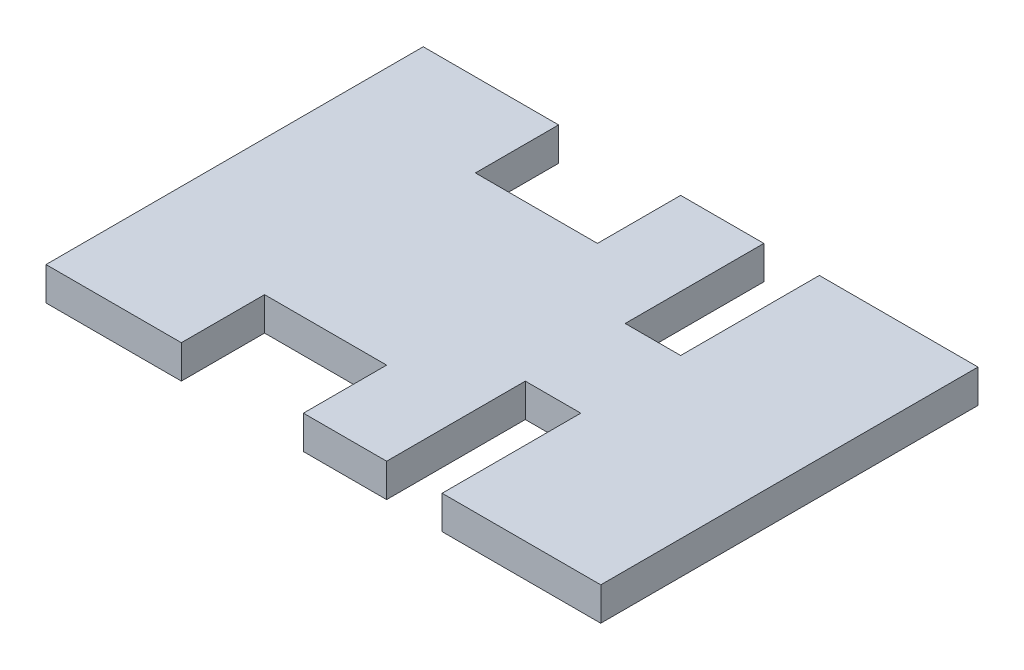
ISO-10303-21;
HEADER;
FILE_DESCRIPTION(('STEP AP214'),'2;1');
FILE_NAME('part.step','',(''),(''),'','','');
FILE_SCHEMA(('AUTOMOTIVE_DESIGN { 1 0 10303 214 1 1 1 1 }'));
ENDSEC;
DATA;
#1=APPLICATION_CONTEXT('core data for automotive mechanical design processes');
#2=APPLICATION_PROTOCOL_DEFINITION('international standard','automotive_design',2000,#1);
#3=PRODUCT_CONTEXT('',#1,'mechanical');
#4=PRODUCT('Part','Part','',(#3));
#5=PRODUCT_RELATED_PRODUCT_CATEGORY('part','',(#4));
#6=PRODUCT_DEFINITION_FORMATION('','',#4);
#7=PRODUCT_DEFINITION_CONTEXT('part definition',#1,'design');
#8=PRODUCT_DEFINITION('design','',#6,#7);
#9=PRODUCT_DEFINITION_SHAPE('','',#8);
#10=(LENGTH_UNIT() NAMED_UNIT(*) SI_UNIT(.MILLI.,.METRE.));
#11=(NAMED_UNIT(*) PLANE_ANGLE_UNIT() SI_UNIT($,.RADIAN.));
#12=(NAMED_UNIT(*) SI_UNIT($,.STERADIAN.) SOLID_ANGLE_UNIT());
#13=UNCERTAINTY_MEASURE_WITH_UNIT(LENGTH_MEASURE(1.E-05),#10,'distance_accuracy_value','');
#14=(GEOMETRIC_REPRESENTATION_CONTEXT(3) GLOBAL_UNCERTAINTY_ASSIGNED_CONTEXT((#13)) GLOBAL_UNIT_ASSIGNED_CONTEXT((#10,
#11,#12)) REPRESENTATION_CONTEXT('',''));
#15=CARTESIAN_POINT('',(0.,0.,0.));
#16=DIRECTION('',(0.,0.,1.));
#17=DIRECTION('',(1.,0.,0.));
#18=AXIS2_PLACEMENT_3D('',#15,#16,#17);
#19=CARTESIAN_POINT('',(-50.,6.,-34.));
#20=DIRECTION('',(0.,0.,1.));
#21=DIRECTION('',(1.,0.,0.));
#22=AXIS2_PLACEMENT_3D('',#19,#20,#21);
#23=PLANE('',#22);
#24=DIRECTION('',(0.,1.,0.));
#25=VECTOR('',#24,1.);
#26=CARTESIAN_POINT('',(-3.59999999999995,0.,-34.));
#27=LINE('',#26,#25);
#28=CARTESIAN_POINT('',(-3.59999999999995,0.,-34.));
#29=VERTEX_POINT('',#28);
#30=CARTESIAN_POINT('',(-3.59999999999995,6.,-34.));
#31=VERTEX_POINT('',#30);
#32=EDGE_CURVE('E171',#29,#31,#27,.T.);
#33=ORIENTED_EDGE('',*,*,#32,.T.);
#34=DIRECTION('',(-1.,0.,0.));
#35=VECTOR('',#34,1.);
#36=CARTESIAN_POINT('',(-50.,6.,-34.));
#37=LINE('',#36,#35);
#38=CARTESIAN_POINT('',(11.4000000000001,6.,-34.));
#39=VERTEX_POINT('',#38);
#40=EDGE_CURVE('E252',#39,#31,#37,.T.);
#41=ORIENTED_EDGE('',*,*,#40,.F.);
#42=DIRECTION('',(0.,1.,0.));
#43=VECTOR('',#42,1.);
#44=CARTESIAN_POINT('',(11.4000000000001,0.,-34.));
#45=LINE('',#44,#43);
#46=CARTESIAN_POINT('',(11.4000000000001,0.,-34.));
#47=VERTEX_POINT('',#46);
#48=EDGE_CURVE('E197',#47,#39,#45,.T.);
#49=ORIENTED_EDGE('',*,*,#48,.F.);
#50=DIRECTION('',(-1.,0.,0.));
#51=VECTOR('',#50,1.);
#52=CARTESIAN_POINT('',(-50.,0.,-34.));
#53=LINE('',#52,#51);
#54=EDGE_CURVE('E191',#47,#29,#53,.T.);
#55=ORIENTED_EDGE('',*,*,#54,.T.);
#56=EDGE_LOOP('',(#33,#41,#49,#55));
#57=FACE_BOUND('',#56,.T.);
#58=ADVANCED_FACE('F35',(#57),#23,.F.);
#59=DIRECTION('',(0.,1.,0.));
#60=VECTOR('',#59,1.);
#61=CARTESIAN_POINT('',(-25.5999999999999,0.,-34.));
#62=LINE('',#61,#60);
#63=CARTESIAN_POINT('',(-25.5999999999999,0.,-34.));
#64=VERTEX_POINT('',#63);
#65=CARTESIAN_POINT('',(-25.5999999999999,6.,-34.));
#66=VERTEX_POINT('',#65);
#67=EDGE_CURVE('E183',#64,#66,#62,.T.);
#68=ORIENTED_EDGE('',*,*,#67,.F.);
#69=CARTESIAN_POINT('',(-50.,0.,-34.));
#70=VERTEX_POINT('',#69);
#71=EDGE_CURVE('E199',#64,#70,#53,.T.);
#72=ORIENTED_EDGE('',*,*,#71,.T.);
#73=DIRECTION('',(0.,-1.,0.));
#74=VECTOR('',#73,1.);
#75=CARTESIAN_POINT('',(-50.,6.,-34.));
#76=LINE('',#75,#74);
#77=CARTESIAN_POINT('',(-50.,6.,-34.));
#78=VERTEX_POINT('',#77);
#79=EDGE_CURVE('E43',#78,#70,#76,.T.);
#80=ORIENTED_EDGE('',*,*,#79,.F.);
#81=EDGE_CURVE('E254',#66,#78,#37,.T.);
#82=ORIENTED_EDGE('',*,*,#81,.F.);
#83=EDGE_LOOP('',(#68,#72,#80,#82));
#84=FACE_BOUND('',#83,.T.);
#85=ADVANCED_FACE('F341',(#84),#23,.F.);
#86=CARTESIAN_POINT('',(0.,6.,0.));
#87=DIRECTION('',(0.,1.,0.));
#88=DIRECTION('',(0.,0.,1.));
#89=AXIS2_PLACEMENT_3D('',#86,#87,#88);
#90=PLANE('',#89);
#91=ORIENTED_EDGE('',*,*,#40,.T.);
#92=DIRECTION('',(0.,0.,1.));
#93=VECTOR('',#92,1.);
#94=CARTESIAN_POINT('',(-3.59999999999995,6.,-34.));
#95=LINE('',#94,#93);
#96=CARTESIAN_POINT('',(-3.59999999999994,6.,-19.));
#97=VERTEX_POINT('',#96);
#98=EDGE_CURVE('E178',#31,#97,#95,.T.);
#99=ORIENTED_EDGE('',*,*,#98,.T.);
#100=DIRECTION('',(-1.,0.,0.));
#101=VECTOR('',#100,1.);
#102=CARTESIAN_POINT('',(-3.59999999999994,6.,-19.));
#103=LINE('',#102,#101);
#104=CARTESIAN_POINT('',(-25.5999999999999,6.,-19.));
#105=VERTEX_POINT('',#104);
#106=EDGE_CURVE('E194',#97,#105,#103,.T.);
#107=ORIENTED_EDGE('',*,*,#106,.T.);
#108=DIRECTION('',(0.,0.,-1.));
#109=VECTOR('',#108,1.);
#110=CARTESIAN_POINT('',(-25.5999999999999,6.,-34.));
#111=LINE('',#110,#109);
#112=EDGE_CURVE('E334',#105,#66,#111,.T.);
#113=ORIENTED_EDGE('',*,*,#112,.T.);
#114=ORIENTED_EDGE('',*,*,#81,.T.);
#115=DIRECTION('',(0.,0.,1.));
#116=VECTOR('',#115,1.);
#117=CARTESIAN_POINT('',(-50.,6.,-34.));
#118=LINE('',#117,#116);
#119=CARTESIAN_POINT('',(-50.,6.,34.));
#120=VERTEX_POINT('',#119);
#121=EDGE_CURVE('E227',#78,#120,#118,.T.);
#122=ORIENTED_EDGE('',*,*,#121,.T.);
#123=DIRECTION('',(1.,0.,0.));
#124=VECTOR('',#123,1.);
#125=CARTESIAN_POINT('',(-50.,6.,34.));
#126=LINE('',#125,#124);
#127=CARTESIAN_POINT('',(-25.5999999999999,6.,34.));
#128=VERTEX_POINT('',#127);
#129=EDGE_CURVE('E218',#120,#128,#126,.T.);
#130=ORIENTED_EDGE('',*,*,#129,.T.);
#131=DIRECTION('',(0.,0.,1.));
#132=VECTOR('',#131,1.);
#133=CARTESIAN_POINT('',(-25.5999999999999,6.,34.));
#134=LINE('',#133,#132);
#135=CARTESIAN_POINT('',(-25.5999999999999,6.,19.));
#136=VERTEX_POINT('',#135);
#137=EDGE_CURVE('E291',#136,#128,#134,.T.);
#138=ORIENTED_EDGE('',*,*,#137,.F.);
#139=DIRECTION('',(-1.,0.,0.));
#140=VECTOR('',#139,1.);
#141=CARTESIAN_POINT('',(-3.59999999999994,6.,19.));
#142=LINE('',#141,#140);
#143=CARTESIAN_POINT('',(-3.59999999999994,6.,19.));
#144=VERTEX_POINT('',#143);
#145=EDGE_CURVE('E294',#144,#136,#142,.T.);
#146=ORIENTED_EDGE('',*,*,#145,.F.);
#147=DIRECTION('',(0.,0.,-1.));
#148=VECTOR('',#147,1.);
#149=CARTESIAN_POINT('',(-3.59999999999995,6.,34.));
#150=LINE('',#149,#148);
#151=CARTESIAN_POINT('',(-3.59999999999995,6.,34.));
#152=VERTEX_POINT('',#151);
#153=EDGE_CURVE('E297',#152,#144,#150,.T.);
#154=ORIENTED_EDGE('',*,*,#153,.F.);
#155=CARTESIAN_POINT('',(11.4000000000001,6.,34.));
#156=VERTEX_POINT('',#155);
#157=EDGE_CURVE('E243',#152,#156,#126,.T.);
#158=ORIENTED_EDGE('',*,*,#157,.T.);
#159=DIRECTION('',(0.,0.,1.));
#160=VECTOR('',#159,1.);
#161=CARTESIAN_POINT('',(11.4000000000001,6.,34.));
#162=LINE('',#161,#160);
#163=CARTESIAN_POINT('',(11.4000000000001,6.,9.));
#164=VERTEX_POINT('',#163);
#165=EDGE_CURVE('E267',#164,#156,#162,.T.);
#166=ORIENTED_EDGE('',*,*,#165,.F.);
#167=DIRECTION('',(-1.,0.,0.));
#168=VECTOR('',#167,1.);
#169=CARTESIAN_POINT('',(21.4000000000001,6.,9.));
#170=LINE('',#169,#168);
#171=CARTESIAN_POINT('',(21.4000000000001,6.,9.));
#172=VERTEX_POINT('',#171);
#173=EDGE_CURVE('E271',#172,#164,#170,.T.);
#174=ORIENTED_EDGE('',*,*,#173,.F.);
#175=DIRECTION('',(0.,0.,-1.));
#176=VECTOR('',#175,1.);
#177=CARTESIAN_POINT('',(21.4000000000001,6.,34.));
#178=LINE('',#177,#176);
#179=CARTESIAN_POINT('',(21.4000000000001,6.,34.));
#180=VERTEX_POINT('',#179);
#181=EDGE_CURVE('E274',#180,#172,#178,.T.);
#182=ORIENTED_EDGE('',*,*,#181,.F.);
#183=CARTESIAN_POINT('',(50.,6.,34.));
#184=VERTEX_POINT('',#183);
#185=EDGE_CURVE('E244',#180,#184,#126,.T.);
#186=ORIENTED_EDGE('',*,*,#185,.T.);
#187=DIRECTION('',(0.,0.,-1.));
#188=VECTOR('',#187,1.);
#189=CARTESIAN_POINT('',(50.,6.,-34.));
#190=LINE('',#189,#188);
#191=CARTESIAN_POINT('',(50.,6.,-34.));
#192=VERTEX_POINT('',#191);
#193=EDGE_CURVE('E212',#184,#192,#190,.T.);
#194=ORIENTED_EDGE('',*,*,#193,.T.);
#195=CARTESIAN_POINT('',(21.4000000000001,6.,-34.));
#196=VERTEX_POINT('',#195);
#197=EDGE_CURVE('E250',#192,#196,#37,.T.);
#198=ORIENTED_EDGE('',*,*,#197,.T.);
#199=DIRECTION('',(0.,0.,1.));
#200=VECTOR('',#199,1.);
#201=CARTESIAN_POINT('',(21.4000000000001,6.,-34.));
#202=LINE('',#201,#200);
#203=CARTESIAN_POINT('',(21.4000000000001,6.,-9.));
#204=VERTEX_POINT('',#203);
#205=EDGE_CURVE('E321',#196,#204,#202,.T.);
#206=ORIENTED_EDGE('',*,*,#205,.T.);
#207=DIRECTION('',(-1.,0.,0.));
#208=VECTOR('',#207,1.);
#209=CARTESIAN_POINT('',(21.4000000000001,6.,-9.));
#210=LINE('',#209,#208);
#211=CARTESIAN_POINT('',(11.4000000000001,6.,-9.));
#212=VERTEX_POINT('',#211);
#213=EDGE_CURVE('E314',#204,#212,#210,.T.);
#214=ORIENTED_EDGE('',*,*,#213,.T.);
#215=DIRECTION('',(0.,0.,-1.));
#216=VECTOR('',#215,1.);
#217=CARTESIAN_POINT('',(11.4000000000001,6.,-34.));
#218=LINE('',#217,#216);
#219=EDGE_CURVE('E318',#212,#39,#218,.T.);
#220=ORIENTED_EDGE('',*,*,#219,.T.);
#221=EDGE_LOOP('',(#91,#99,#107,#113,#114,#122,#130,#138,#146,#154,#158,#166,#174,#182,#186,
#194,#198,#206,#214,#220));
#222=FACE_BOUND('',#221,.T.);
#223=ADVANCED_FACE('F342',(#222),#90,.T.);
#224=CARTESIAN_POINT('',(0.,0.,0.));
#225=DIRECTION('',(0.,1.,0.));
#226=DIRECTION('',(0.,0.,1.));
#227=AXIS2_PLACEMENT_3D('',#224,#225,#226);
#228=PLANE('',#227);
#229=DIRECTION('',(0.,0.,1.));
#230=VECTOR('',#229,1.);
#231=CARTESIAN_POINT('',(-3.59999999999995,0.,-34.));
#232=LINE('',#231,#230);
#233=CARTESIAN_POINT('',(-3.59999999999994,0.,-19.));
#234=VERTEX_POINT('',#233);
#235=EDGE_CURVE('E175',#29,#234,#232,.T.);
#236=ORIENTED_EDGE('',*,*,#235,.F.);
#237=ORIENTED_EDGE('',*,*,#54,.F.);
#238=DIRECTION('',(0.,0.,-1.));
#239=VECTOR('',#238,1.);
#240=CARTESIAN_POINT('',(11.4000000000001,0.,-34.));
#241=LINE('',#240,#239);
#242=CARTESIAN_POINT('',(11.4000000000001,0.,-9.));
#243=VERTEX_POINT('',#242);
#244=EDGE_CURVE('E326',#243,#47,#241,.T.);
#245=ORIENTED_EDGE('',*,*,#244,.F.);
#246=DIRECTION('',(-1.,0.,0.));
#247=VECTOR('',#246,1.);
#248=CARTESIAN_POINT('',(21.4000000000001,0.,-9.));
#249=LINE('',#248,#247);
#250=CARTESIAN_POINT('',(21.4000000000001,0.,-9.));
#251=VERTEX_POINT('',#250);
#252=EDGE_CURVE('E309',#251,#243,#249,.T.);
#253=ORIENTED_EDGE('',*,*,#252,.F.);
#254=DIRECTION('',(0.,0.,1.));
#255=VECTOR('',#254,1.);
#256=CARTESIAN_POINT('',(21.4000000000001,0.,-34.));
#257=LINE('',#256,#255);
#258=CARTESIAN_POINT('',(21.4000000000001,0.,-34.));
#259=VERTEX_POINT('',#258);
#260=EDGE_CURVE('E317',#259,#251,#257,.T.);
#261=ORIENTED_EDGE('',*,*,#260,.F.);
#262=CARTESIAN_POINT('',(50.,0.,-34.));
#263=VERTEX_POINT('',#262);
#264=EDGE_CURVE('E198',#263,#259,#53,.T.);
#265=ORIENTED_EDGE('',*,*,#264,.F.);
#266=DIRECTION('',(0.,0.,-1.));
#267=VECTOR('',#266,1.);
#268=CARTESIAN_POINT('',(50.,0.,-34.));
#269=LINE('',#268,#267);
#270=CARTESIAN_POINT('',(50.,0.,34.));
#271=VERTEX_POINT('',#270);
#272=EDGE_CURVE('E203',#271,#263,#269,.T.);
#273=ORIENTED_EDGE('',*,*,#272,.F.);
#274=DIRECTION('',(1.,0.,0.));
#275=VECTOR('',#274,1.);
#276=CARTESIAN_POINT('',(-50.,0.,34.));
#277=LINE('',#276,#275);
#278=CARTESIAN_POINT('',(21.4000000000001,0.,34.));
#279=VERTEX_POINT('',#278);
#280=EDGE_CURVE('E208',#279,#271,#277,.T.);
#281=ORIENTED_EDGE('',*,*,#280,.F.);
#282=DIRECTION('',(0.,0.,-1.));
#283=VECTOR('',#282,1.);
#284=CARTESIAN_POINT('',(21.4000000000001,0.,34.));
#285=LINE('',#284,#283);
#286=CARTESIAN_POINT('',(21.4000000000001,0.,9.));
#287=VERTEX_POINT('',#286);
#288=EDGE_CURVE('E270',#279,#287,#285,.T.);
#289=ORIENTED_EDGE('',*,*,#288,.T.);
#290=DIRECTION('',(-1.,0.,0.));
#291=VECTOR('',#290,1.);
#292=CARTESIAN_POINT('',(21.4000000000001,0.,9.));
#293=LINE('',#292,#291);
#294=CARTESIAN_POINT('',(11.4000000000001,0.,9.));
#295=VERTEX_POINT('',#294);
#296=EDGE_CURVE('E280',#287,#295,#293,.T.);
#297=ORIENTED_EDGE('',*,*,#296,.T.);
#298=DIRECTION('',(0.,0.,1.));
#299=VECTOR('',#298,1.);
#300=CARTESIAN_POINT('',(11.4000000000001,0.,34.));
#301=LINE('',#300,#299);
#302=CARTESIAN_POINT('',(11.4000000000001,0.,34.));
#303=VERTEX_POINT('',#302);
#304=EDGE_CURVE('E260',#295,#303,#301,.T.);
#305=ORIENTED_EDGE('',*,*,#304,.T.);
#306=CARTESIAN_POINT('',(-3.59999999999995,0.,34.));
#307=VERTEX_POINT('',#306);
#308=EDGE_CURVE('E213',#307,#303,#277,.T.);
#309=ORIENTED_EDGE('',*,*,#308,.F.);
#310=DIRECTION('',(0.,0.,-1.));
#311=VECTOR('',#310,1.);
#312=CARTESIAN_POINT('',(-3.59999999999995,0.,34.));
#313=LINE('',#312,#311);
#314=CARTESIAN_POINT('',(-3.59999999999994,0.,19.));
#315=VERTEX_POINT('',#314);
#316=EDGE_CURVE('E293',#307,#315,#313,.T.);
#317=ORIENTED_EDGE('',*,*,#316,.T.);
#318=DIRECTION('',(-1.,0.,0.));
#319=VECTOR('',#318,1.);
#320=CARTESIAN_POINT('',(-3.59999999999994,0.,19.));
#321=LINE('',#320,#319);
#322=CARTESIAN_POINT('',(-25.5999999999999,0.,19.));
#323=VERTEX_POINT('',#322);
#324=EDGE_CURVE('E302',#315,#323,#321,.T.);
#325=ORIENTED_EDGE('',*,*,#324,.T.);
#326=DIRECTION('',(0.,0.,1.));
#327=VECTOR('',#326,1.);
#328=CARTESIAN_POINT('',(-25.5999999999999,0.,34.));
#329=LINE('',#328,#327);
#330=CARTESIAN_POINT('',(-25.5999999999999,0.,34.));
#331=VERTEX_POINT('',#330);
#332=EDGE_CURVE('E234',#323,#331,#329,.T.);
#333=ORIENTED_EDGE('',*,*,#332,.T.);
#334=CARTESIAN_POINT('',(-50.,0.,34.));
#335=VERTEX_POINT('',#334);
#336=EDGE_CURVE('E209',#335,#331,#277,.T.);
#337=ORIENTED_EDGE('',*,*,#336,.F.);
#338=DIRECTION('',(0.,0.,1.));
#339=VECTOR('',#338,1.);
#340=CARTESIAN_POINT('',(-50.,0.,-34.));
#341=LINE('',#340,#339);
#342=EDGE_CURVE('E202',#70,#335,#341,.T.);
#343=ORIENTED_EDGE('',*,*,#342,.F.);
#344=ORIENTED_EDGE('',*,*,#71,.F.);
#345=DIRECTION('',(0.,0.,-1.));
#346=VECTOR('',#345,1.);
#347=CARTESIAN_POINT('',(-25.5999999999999,0.,-34.));
#348=LINE('',#347,#346);
#349=CARTESIAN_POINT('',(-25.5999999999999,0.,-19.));
#350=VERTEX_POINT('',#349);
#351=EDGE_CURVE('E193',#350,#64,#348,.T.);
#352=ORIENTED_EDGE('',*,*,#351,.F.);
#353=DIRECTION('',(-1.,0.,0.));
#354=VECTOR('',#353,1.);
#355=CARTESIAN_POINT('',(-3.59999999999994,0.,-19.));
#356=LINE('',#355,#354);
#357=EDGE_CURVE('E184',#234,#350,#356,.T.);
#358=ORIENTED_EDGE('',*,*,#357,.F.);
#359=EDGE_LOOP('',(#236,#237,#245,#253,#261,#265,#273,#281,#289,#297,#305,#309,#317,#325,#333,
#337,#343,#344,#352,#358));
#360=FACE_BOUND('',#359,.T.);
#361=ADVANCED_FACE('F189',(#360),#228,.F.);
#362=DIRECTION('',(0.,1.,0.));
#363=VECTOR('',#362,1.);
#364=CARTESIAN_POINT('',(21.4000000000001,0.,-34.));
#365=LINE('',#364,#363);
#366=EDGE_CURVE('E306',#259,#196,#365,.T.);
#367=ORIENTED_EDGE('',*,*,#366,.T.);
#368=ORIENTED_EDGE('',*,*,#197,.F.);
#369=DIRECTION('',(0.,-1.,0.));
#370=VECTOR('',#369,1.);
#371=CARTESIAN_POINT('',(50.,6.,-34.));
#372=LINE('',#371,#370);
#373=EDGE_CURVE('E11',#192,#263,#372,.T.);
#374=ORIENTED_EDGE('',*,*,#373,.T.);
#375=ORIENTED_EDGE('',*,*,#264,.T.);
#376=EDGE_LOOP('',(#367,#368,#374,#375));
#377=FACE_BOUND('',#376,.T.);
#378=ADVANCED_FACE('F354',(#377),#23,.F.);
#379=CARTESIAN_POINT('',(-50.,6.,34.));
#380=DIRECTION('',(0.,0.,-1.));
#381=DIRECTION('',(-1.,0.,0.));
#382=AXIS2_PLACEMENT_3D('',#379,#380,#381);
#383=PLANE('',#382);
#384=ORIENTED_EDGE('',*,*,#157,.F.);
#385=DIRECTION('',(0.,1.,0.));
#386=VECTOR('',#385,1.);
#387=CARTESIAN_POINT('',(-3.59999999999995,0.,34.));
#388=LINE('',#387,#386);
#389=EDGE_CURVE('E277',#307,#152,#388,.T.);
#390=ORIENTED_EDGE('',*,*,#389,.F.);
#391=ORIENTED_EDGE('',*,*,#308,.T.);
#392=DIRECTION('',(0.,1.,0.));
#393=VECTOR('',#392,1.);
#394=CARTESIAN_POINT('',(11.4000000000001,0.,34.));
#395=LINE('',#394,#393);
#396=EDGE_CURVE('E262',#303,#156,#395,.T.);
#397=ORIENTED_EDGE('',*,*,#396,.T.);
#398=EDGE_LOOP('',(#384,#390,#391,#397));
#399=FACE_BOUND('',#398,.T.);
#400=ADVANCED_FACE('F367',(#399),#383,.F.);
#401=ORIENTED_EDGE('',*,*,#185,.F.);
#402=DIRECTION('',(0.,1.,0.));
#403=VECTOR('',#402,1.);
#404=CARTESIAN_POINT('',(21.4000000000001,0.,34.));
#405=LINE('',#404,#403);
#406=EDGE_CURVE('E265',#279,#180,#405,.T.);
#407=ORIENTED_EDGE('',*,*,#406,.F.);
#408=ORIENTED_EDGE('',*,*,#280,.T.);
#409=DIRECTION('',(0.,-1.,0.));
#410=VECTOR('',#409,1.);
#411=CARTESIAN_POINT('',(50.,6.,34.));
#412=LINE('',#411,#410);
#413=EDGE_CURVE('E214',#184,#271,#412,.T.);
#414=ORIENTED_EDGE('',*,*,#413,.F.);
#415=EDGE_LOOP('',(#401,#407,#408,#414));
#416=FACE_BOUND('',#415,.T.);
#417=ADVANCED_FACE('F360',(#416),#383,.F.);
#418=CARTESIAN_POINT('',(50.,6.,-34.));
#419=DIRECTION('',(-1.,0.,0.));
#420=DIRECTION('',(0.,0.,1.));
#421=AXIS2_PLACEMENT_3D('',#418,#419,#420);
#422=PLANE('',#421);
#423=ORIENTED_EDGE('',*,*,#272,.T.);
#424=ORIENTED_EDGE('',*,*,#373,.F.);
#425=ORIENTED_EDGE('',*,*,#193,.F.);
#426=ORIENTED_EDGE('',*,*,#413,.T.);
#427=EDGE_LOOP('',(#423,#424,#425,#426));
#428=FACE_BOUND('',#427,.T.);
#429=ADVANCED_FACE('F37',(#428),#422,.F.);
#430=CARTESIAN_POINT('',(-50.,6.,-34.));
#431=DIRECTION('',(1.,0.,0.));
#432=DIRECTION('',(0.,0.,-1.));
#433=AXIS2_PLACEMENT_3D('',#430,#431,#432);
#434=PLANE('',#433);
#435=ORIENTED_EDGE('',*,*,#342,.T.);
#436=DIRECTION('',(0.,-1.,0.));
#437=VECTOR('',#436,1.);
#438=CARTESIAN_POINT('',(-50.,6.,34.));
#439=LINE('',#438,#437);
#440=EDGE_CURVE('E217',#120,#335,#439,.T.);
#441=ORIENTED_EDGE('',*,*,#440,.F.);
#442=ORIENTED_EDGE('',*,*,#121,.F.);
#443=ORIENTED_EDGE('',*,*,#79,.T.);
#444=EDGE_LOOP('',(#435,#441,#442,#443));
#445=FACE_BOUND('',#444,.T.);
#446=ADVANCED_FACE('F225',(#445),#434,.F.);
#447=ORIENTED_EDGE('',*,*,#336,.T.);
#448=DIRECTION('',(0.,1.,0.));
#449=VECTOR('',#448,1.);
#450=CARTESIAN_POINT('',(-25.5999999999999,0.,34.));
#451=LINE('',#450,#449);
#452=EDGE_CURVE('E239',#331,#128,#451,.T.);
#453=ORIENTED_EDGE('',*,*,#452,.T.);
#454=ORIENTED_EDGE('',*,*,#129,.F.);
#455=ORIENTED_EDGE('',*,*,#440,.T.);
#456=EDGE_LOOP('',(#447,#453,#454,#455));
#457=FACE_BOUND('',#456,.T.);
#458=ADVANCED_FACE('F237',(#457),#383,.F.);
#459=CARTESIAN_POINT('',(21.4000000000001,0.,34.));
#460=DIRECTION('',(1.,0.,0.));
#461=DIRECTION('',(0.,0.,-1.));
#462=AXIS2_PLACEMENT_3D('',#459,#460,#461);
#463=PLANE('',#462);
#464=ORIENTED_EDGE('',*,*,#181,.T.);
#465=DIRECTION('',(0.,1.,0.));
#466=VECTOR('',#465,1.);
#467=CARTESIAN_POINT('',(21.4000000000001,0.,9.));
#468=LINE('',#467,#466);
#469=EDGE_CURVE('E257',#287,#172,#468,.T.);
#470=ORIENTED_EDGE('',*,*,#469,.F.);
#471=ORIENTED_EDGE('',*,*,#288,.F.);
#472=ORIENTED_EDGE('',*,*,#406,.T.);
#473=EDGE_LOOP('',(#464,#470,#471,#472));
#474=FACE_BOUND('',#473,.T.);
#475=ADVANCED_FACE('F413',(#474),#463,.F.);
#476=CARTESIAN_POINT('',(11.4000000000001,0.,34.));
#477=DIRECTION('',(-1.,0.,0.));
#478=DIRECTION('',(0.,0.,1.));
#479=AXIS2_PLACEMENT_3D('',#476,#477,#478);
#480=PLANE('',#479);
#481=ORIENTED_EDGE('',*,*,#165,.T.);
#482=ORIENTED_EDGE('',*,*,#396,.F.);
#483=ORIENTED_EDGE('',*,*,#304,.F.);
#484=DIRECTION('',(0.,1.,0.));
#485=VECTOR('',#484,1.);
#486=CARTESIAN_POINT('',(11.4000000000001,0.,9.));
#487=LINE('',#486,#485);
#488=EDGE_CURVE('E259',#295,#164,#487,.T.);
#489=ORIENTED_EDGE('',*,*,#488,.T.);
#490=EDGE_LOOP('',(#481,#482,#483,#489));
#491=FACE_BOUND('',#490,.T.);
#492=ADVANCED_FACE('F369',(#491),#480,.F.);
#493=CARTESIAN_POINT('',(21.4000000000001,0.,9.));
#494=DIRECTION('',(0.,0.,-1.));
#495=DIRECTION('',(-1.,0.,0.));
#496=AXIS2_PLACEMENT_3D('',#493,#494,#495);
#497=PLANE('',#496);
#498=ORIENTED_EDGE('',*,*,#173,.T.);
#499=ORIENTED_EDGE('',*,*,#488,.F.);
#500=ORIENTED_EDGE('',*,*,#296,.F.);
#501=ORIENTED_EDGE('',*,*,#469,.T.);
#502=EDGE_LOOP('',(#498,#499,#500,#501));
#503=FACE_BOUND('',#502,.T.);
#504=ADVANCED_FACE('F374',(#503),#497,.F.);
#505=CARTESIAN_POINT('',(-3.59999999999995,0.,34.));
#506=DIRECTION('',(1.,0.,0.));
#507=DIRECTION('',(0.,0.,-1.));
#508=AXIS2_PLACEMENT_3D('',#505,#506,#507);
#509=PLANE('',#508);
#510=ORIENTED_EDGE('',*,*,#153,.T.);
#511=DIRECTION('',(0.,1.,0.));
#512=VECTOR('',#511,1.);
#513=CARTESIAN_POINT('',(-3.59999999999994,0.,19.));
#514=LINE('',#513,#512);
#515=EDGE_CURVE('E285',#315,#144,#514,.T.);
#516=ORIENTED_EDGE('',*,*,#515,.F.);
#517=ORIENTED_EDGE('',*,*,#316,.F.);
#518=ORIENTED_EDGE('',*,*,#389,.T.);
#519=EDGE_LOOP('',(#510,#516,#517,#518));
#520=FACE_BOUND('',#519,.T.);
#521=ADVANCED_FACE('F379',(#520),#509,.F.);
#522=CARTESIAN_POINT('',(-25.5999999999999,0.,34.));
#523=DIRECTION('',(-1.,0.,0.));
#524=DIRECTION('',(0.,0.,1.));
#525=AXIS2_PLACEMENT_3D('',#522,#523,#524);
#526=PLANE('',#525);
#527=ORIENTED_EDGE('',*,*,#137,.T.);
#528=ORIENTED_EDGE('',*,*,#452,.F.);
#529=ORIENTED_EDGE('',*,*,#332,.F.);
#530=DIRECTION('',(0.,1.,0.));
#531=VECTOR('',#530,1.);
#532=CARTESIAN_POINT('',(-25.5999999999999,0.,19.));
#533=LINE('',#532,#531);
#534=EDGE_CURVE('E287',#323,#136,#533,.T.);
#535=ORIENTED_EDGE('',*,*,#534,.T.);
#536=EDGE_LOOP('',(#527,#528,#529,#535));
#537=FACE_BOUND('',#536,.T.);
#538=ADVANCED_FACE('F385',(#537),#526,.F.);
#539=CARTESIAN_POINT('',(-3.59999999999994,0.,19.));
#540=DIRECTION('',(0.,0.,-1.));
#541=DIRECTION('',(-1.,0.,0.));
#542=AXIS2_PLACEMENT_3D('',#539,#540,#541);
#543=PLANE('',#542);
#544=ORIENTED_EDGE('',*,*,#145,.T.);
#545=ORIENTED_EDGE('',*,*,#534,.F.);
#546=ORIENTED_EDGE('',*,*,#324,.F.);
#547=ORIENTED_EDGE('',*,*,#515,.T.);
#548=EDGE_LOOP('',(#544,#545,#546,#547));
#549=FACE_BOUND('',#548,.T.);
#550=ADVANCED_FACE('F383',(#549),#543,.F.);
#551=CARTESIAN_POINT('',(21.4000000000001,0.,-34.));
#552=DIRECTION('',(-1.,0.,0.));
#553=DIRECTION('',(0.,0.,1.));
#554=AXIS2_PLACEMENT_3D('',#551,#552,#553);
#555=PLANE('',#554);
#556=ORIENTED_EDGE('',*,*,#205,.F.);
#557=ORIENTED_EDGE('',*,*,#366,.F.);
#558=ORIENTED_EDGE('',*,*,#260,.T.);
#559=DIRECTION('',(0.,1.,0.));
#560=VECTOR('',#559,1.);
#561=CARTESIAN_POINT('',(21.4000000000001,0.,-9.));
#562=LINE('',#561,#560);
#563=EDGE_CURVE('E300',#251,#204,#562,.T.);
#564=ORIENTED_EDGE('',*,*,#563,.T.);
#565=EDGE_LOOP('',(#556,#557,#558,#564));
#566=FACE_BOUND('',#565,.T.);
#567=ADVANCED_FACE('F350',(#566),#555,.T.);
#568=CARTESIAN_POINT('',(21.4000000000001,0.,-9.));
#569=DIRECTION('',(0.,0.,-1.));
#570=DIRECTION('',(-1.,0.,0.));
#571=AXIS2_PLACEMENT_3D('',#568,#569,#570);
#572=PLANE('',#571);
#573=ORIENTED_EDGE('',*,*,#213,.F.);
#574=ORIENTED_EDGE('',*,*,#563,.F.);
#575=ORIENTED_EDGE('',*,*,#252,.T.);
#576=DIRECTION('',(0.,1.,0.));
#577=VECTOR('',#576,1.);
#578=CARTESIAN_POINT('',(11.4000000000001,0.,-9.));
#579=LINE('',#578,#577);
#580=EDGE_CURVE('E58',#243,#212,#579,.T.);
#581=ORIENTED_EDGE('',*,*,#580,.T.);
#582=EDGE_LOOP('',(#573,#574,#575,#581));
#583=FACE_BOUND('',#582,.T.);
#584=ADVANCED_FACE('F348',(#583),#572,.T.);
#585=CARTESIAN_POINT('',(11.4000000000001,0.,-34.));
#586=DIRECTION('',(1.,0.,0.));
#587=DIRECTION('',(0.,0.,-1.));
#588=AXIS2_PLACEMENT_3D('',#585,#586,#587);
#589=PLANE('',#588);
#590=ORIENTED_EDGE('',*,*,#219,.F.);
#591=ORIENTED_EDGE('',*,*,#580,.F.);
#592=ORIENTED_EDGE('',*,*,#244,.T.);
#593=ORIENTED_EDGE('',*,*,#48,.T.);
#594=EDGE_LOOP('',(#590,#591,#592,#593));
#595=FACE_BOUND('',#594,.T.);
#596=ADVANCED_FACE('F343',(#595),#589,.T.);
#597=CARTESIAN_POINT('',(-3.59999999999995,0.,-34.));
#598=DIRECTION('',(-1.,0.,0.));
#599=DIRECTION('',(0.,0.,1.));
#600=AXIS2_PLACEMENT_3D('',#597,#598,#599);
#601=PLANE('',#600);
#602=ORIENTED_EDGE('',*,*,#98,.F.);
#603=ORIENTED_EDGE('',*,*,#32,.F.);
#604=ORIENTED_EDGE('',*,*,#235,.T.);
#605=DIRECTION('',(0.,1.,0.));
#606=VECTOR('',#605,1.);
#607=CARTESIAN_POINT('',(-3.59999999999994,0.,-19.));
#608=LINE('',#607,#606);
#609=EDGE_CURVE('E324',#234,#97,#608,.T.);
#610=ORIENTED_EDGE('',*,*,#609,.T.);
#611=EDGE_LOOP('',(#602,#603,#604,#610));
#612=FACE_BOUND('',#611,.T.);
#613=ADVANCED_FACE('F173',(#612),#601,.T.);
#614=CARTESIAN_POINT('',(-3.59999999999994,0.,-19.));
#615=DIRECTION('',(0.,0.,-1.));
#616=DIRECTION('',(-1.,0.,0.));
#617=AXIS2_PLACEMENT_3D('',#614,#615,#616);
#618=PLANE('',#617);
#619=ORIENTED_EDGE('',*,*,#106,.F.);
#620=ORIENTED_EDGE('',*,*,#609,.F.);
#621=ORIENTED_EDGE('',*,*,#357,.T.);
#622=DIRECTION('',(0.,1.,0.));
#623=VECTOR('',#622,1.);
#624=CARTESIAN_POINT('',(-25.5999999999999,0.,-19.));
#625=LINE('',#624,#623);
#626=EDGE_CURVE('E50',#350,#105,#625,.T.);
#627=ORIENTED_EDGE('',*,*,#626,.T.);
#628=EDGE_LOOP('',(#619,#620,#621,#627));
#629=FACE_BOUND('',#628,.T.);
#630=ADVANCED_FACE('F539',(#629),#618,.T.);
#631=CARTESIAN_POINT('',(-25.5999999999999,0.,-34.));
#632=DIRECTION('',(1.,0.,0.));
#633=DIRECTION('',(0.,0.,-1.));
#634=AXIS2_PLACEMENT_3D('',#631,#632,#633);
#635=PLANE('',#634);
#636=ORIENTED_EDGE('',*,*,#112,.F.);
#637=ORIENTED_EDGE('',*,*,#626,.F.);
#638=ORIENTED_EDGE('',*,*,#351,.T.);
#639=ORIENTED_EDGE('',*,*,#67,.T.);
#640=EDGE_LOOP('',(#636,#637,#638,#639));
#641=FACE_BOUND('',#640,.T.);
#642=ADVANCED_FACE('F340',(#641),#635,.T.);
#643=CLOSED_SHELL('',(#58,#85,#223,#361,#378,#400,#417,#429,#446,#458,#475,#492,#504,#521,#538,
#550,#567,#584,#596,#613,#630,#642));
#644=MANIFOLD_SOLID_BREP('B2',#643);
#645=ADVANCED_BREP_SHAPE_REPRESENTATION('',(#18,#644),#14);
#646=SHAPE_DEFINITION_REPRESENTATION(#9,#645);
ENDSEC;
END-ISO-10303-21;
